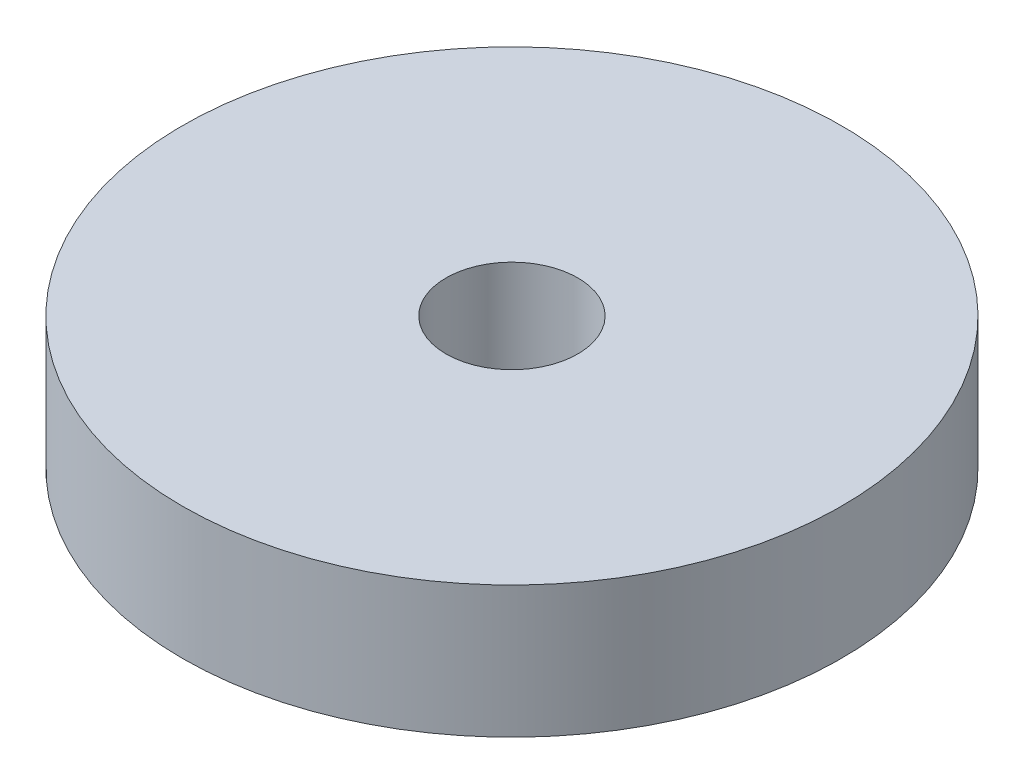
ISO-10303-21;
HEADER;
FILE_DESCRIPTION(('STEP AP214'),'2;1');
FILE_NAME('part.step','',(''),(''),'','','');
FILE_SCHEMA(('AUTOMOTIVE_DESIGN { 1 0 10303 214 1 1 1 1 }'));
ENDSEC;
DATA;
#1=APPLICATION_CONTEXT('core data for automotive mechanical design processes');
#2=APPLICATION_PROTOCOL_DEFINITION('international standard','automotive_design',2000,#1);
#3=PRODUCT_CONTEXT('',#1,'mechanical');
#4=PRODUCT('Part','Part','',(#3));
#5=PRODUCT_RELATED_PRODUCT_CATEGORY('part','',(#4));
#6=PRODUCT_DEFINITION_FORMATION('','',#4);
#7=PRODUCT_DEFINITION_CONTEXT('part definition',#1,'design');
#8=PRODUCT_DEFINITION('design','',#6,#7);
#9=PRODUCT_DEFINITION_SHAPE('','',#8);
#10=(LENGTH_UNIT() NAMED_UNIT(*) SI_UNIT(.MILLI.,.METRE.));
#11=(NAMED_UNIT(*) PLANE_ANGLE_UNIT() SI_UNIT($,.RADIAN.));
#12=(NAMED_UNIT(*) SI_UNIT($,.STERADIAN.) SOLID_ANGLE_UNIT());
#13=UNCERTAINTY_MEASURE_WITH_UNIT(LENGTH_MEASURE(1.E-05),#10,'distance_accuracy_value','');
#14=(GEOMETRIC_REPRESENTATION_CONTEXT(3) GLOBAL_UNCERTAINTY_ASSIGNED_CONTEXT((#13)) GLOBAL_UNIT_ASSIGNED_CONTEXT((#10,
#11,#12)) REPRESENTATION_CONTEXT('',''));
#15=CARTESIAN_POINT('',(0.,0.,0.));
#16=DIRECTION('',(0.,0.,1.));
#17=DIRECTION('',(1.,0.,0.));
#18=AXIS2_PLACEMENT_3D('',#15,#16,#17);
#19=CARTESIAN_POINT('',(0.,3.,0.));
#20=DIRECTION('',(0.,1.,0.));
#21=DIRECTION('',(0.,0.,1.));
#22=AXIS2_PLACEMENT_3D('',#19,#20,#21);
#23=PLANE('',#22);
#24=CARTESIAN_POINT('',(0.,3.,0.));
#25=DIRECTION('',(0.,1.,0.));
#26=DIRECTION('',(0.,0.,1.));
#27=AXIS2_PLACEMENT_3D('',#24,#25,#26);
#28=CIRCLE('',#27,7.5);
#29=CARTESIAN_POINT('',(0.,3.,7.5));
#30=VERTEX_POINT('',#29);
#31=EDGE_CURVE('E10',#30,#30,#28,.T.);
#32=ORIENTED_EDGE('',*,*,#31,.T.);
#33=EDGE_LOOP('',(#32));
#34=FACE_BOUND('',#33,.T.);
#35=CARTESIAN_POINT('',(0.,3.,0.));
#36=DIRECTION('',(0.,1.,0.));
#37=DIRECTION('',(0.,0.,1.));
#38=AXIS2_PLACEMENT_3D('',#35,#36,#37);
#39=CIRCLE('',#38,1.5);
#40=CARTESIAN_POINT('',(0.,3.,1.5));
#41=VERTEX_POINT('',#40);
#42=EDGE_CURVE('E42',#41,#41,#39,.T.);
#43=ORIENTED_EDGE('',*,*,#42,.F.);
#44=EDGE_LOOP('',(#43));
#45=FACE_BOUND('',#44,.T.);
#46=ADVANCED_FACE('F31',(#34,#45),#23,.T.);
#47=CARTESIAN_POINT('',(0.,0.,0.));
#48=DIRECTION('',(0.,1.,0.));
#49=DIRECTION('',(0.,0.,1.));
#50=AXIS2_PLACEMENT_3D('',#47,#48,#49);
#51=PLANE('',#50);
#52=CARTESIAN_POINT('',(0.,0.,0.));
#53=DIRECTION('',(0.,1.,0.));
#54=DIRECTION('',(0.,0.,1.));
#55=AXIS2_PLACEMENT_3D('',#52,#53,#54);
#56=CIRCLE('',#55,7.5);
#57=CARTESIAN_POINT('',(0.,0.,7.5));
#58=VERTEX_POINT('',#57);
#59=EDGE_CURVE('E35',#58,#58,#56,.T.);
#60=ORIENTED_EDGE('',*,*,#59,.F.);
#61=EDGE_LOOP('',(#60));
#62=FACE_BOUND('',#61,.T.);
#63=CARTESIAN_POINT('',(0.,0.,0.));
#64=DIRECTION('',(0.,1.,0.));
#65=DIRECTION('',(0.,0.,1.));
#66=AXIS2_PLACEMENT_3D('',#63,#64,#65);
#67=CIRCLE('',#66,1.5);
#68=CARTESIAN_POINT('',(0.,0.,1.5));
#69=VERTEX_POINT('',#68);
#70=EDGE_CURVE('E44',#69,#69,#67,.T.);
#71=ORIENTED_EDGE('',*,*,#70,.T.);
#72=EDGE_LOOP('',(#71));
#73=FACE_BOUND('',#72,.T.);
#74=ADVANCED_FACE('F54',(#62,#73),#51,.F.);
#75=CARTESIAN_POINT('',(0.,3.,0.));
#76=DIRECTION('',(0.,-1.,0.));
#77=DIRECTION('',(0.,0.,-1.));
#78=AXIS2_PLACEMENT_3D('',#75,#76,#77);
#79=CYLINDRICAL_SURFACE('',#78,7.5);
#80=ORIENTED_EDGE('',*,*,#31,.F.);
#81=EDGE_LOOP('',(#80));
#82=FACE_BOUND('',#81,.T.);
#83=ORIENTED_EDGE('',*,*,#59,.T.);
#84=EDGE_LOOP('',(#83));
#85=FACE_BOUND('',#84,.T.);
#86=ADVANCED_FACE('F33',(#82,#85),#79,.T.);
#87=CARTESIAN_POINT('',(0.,3.,0.));
#88=DIRECTION('',(0.,-1.,0.));
#89=DIRECTION('',(0.,0.,-1.));
#90=AXIS2_PLACEMENT_3D('',#87,#88,#89);
#91=CYLINDRICAL_SURFACE('',#90,1.5);
#92=ORIENTED_EDGE('',*,*,#42,.T.);
#93=EDGE_LOOP('',(#92));
#94=FACE_BOUND('',#93,.T.);
#95=ORIENTED_EDGE('',*,*,#70,.F.);
#96=EDGE_LOOP('',(#95));
#97=FACE_BOUND('',#96,.T.);
#98=ADVANCED_FACE('F50',(#94,#97),#91,.F.);
#99=CLOSED_SHELL('',(#46,#74,#86,#98));
#100=MANIFOLD_SOLID_BREP('B2',#99);
#101=ADVANCED_BREP_SHAPE_REPRESENTATION('',(#18,#100),#14);
#102=SHAPE_DEFINITION_REPRESENTATION(#9,#101);
ENDSEC;
END-ISO-10303-21;
